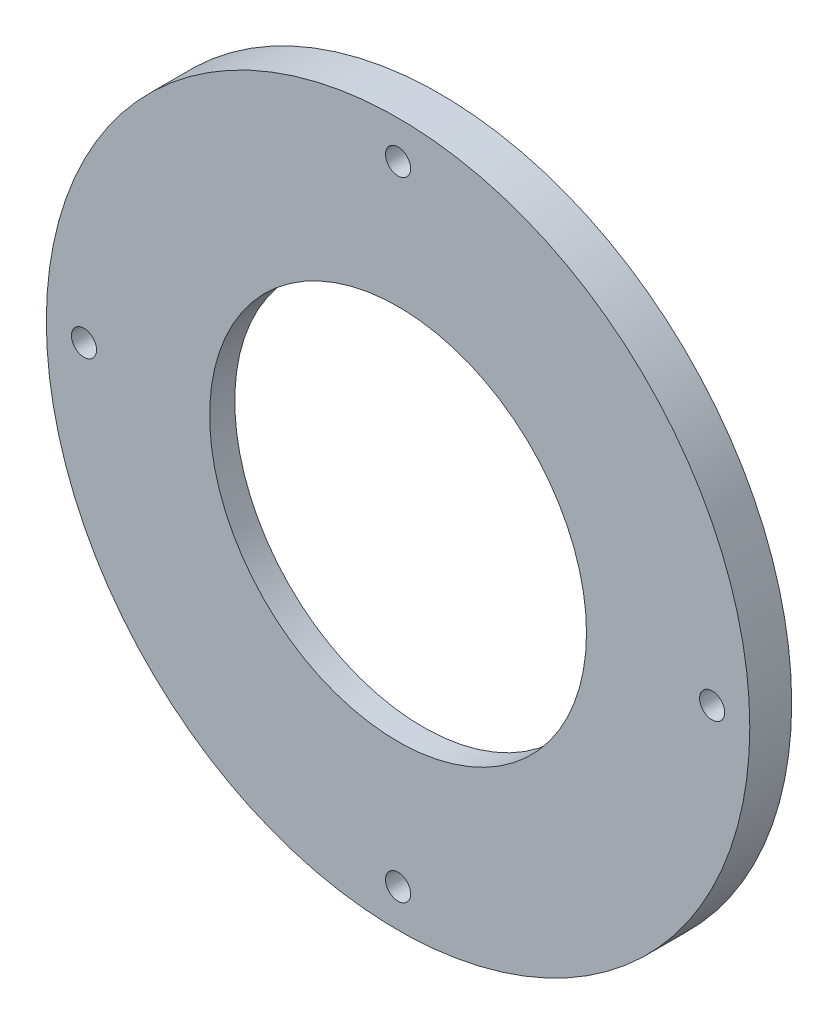
ISO-10303-21;
HEADER;
FILE_DESCRIPTION(('STEP AP214'),'2;1');
FILE_NAME('part.step','',(''),(''),'','','');
FILE_SCHEMA(('AUTOMOTIVE_DESIGN { 1 0 10303 214 1 1 1 1 }'));
ENDSEC;
DATA;
#1=APPLICATION_CONTEXT('core data for automotive mechanical design processes');
#2=APPLICATION_PROTOCOL_DEFINITION('international standard','automotive_design',2000,#1);
#3=PRODUCT_CONTEXT('',#1,'mechanical');
#4=PRODUCT('Part','Part','',(#3));
#5=PRODUCT_RELATED_PRODUCT_CATEGORY('part','',(#4));
#6=PRODUCT_DEFINITION_FORMATION('','',#4);
#7=PRODUCT_DEFINITION_CONTEXT('part definition',#1,'design');
#8=PRODUCT_DEFINITION('design','',#6,#7);
#9=PRODUCT_DEFINITION_SHAPE('','',#8);
#10=(LENGTH_UNIT() NAMED_UNIT(*) SI_UNIT(.MILLI.,.METRE.));
#11=(NAMED_UNIT(*) PLANE_ANGLE_UNIT() SI_UNIT($,.RADIAN.));
#12=(NAMED_UNIT(*) SI_UNIT($,.STERADIAN.) SOLID_ANGLE_UNIT());
#13=UNCERTAINTY_MEASURE_WITH_UNIT(LENGTH_MEASURE(1.E-05),#10,'distance_accuracy_value','');
#14=(GEOMETRIC_REPRESENTATION_CONTEXT(3) GLOBAL_UNCERTAINTY_ASSIGNED_CONTEXT((#13)) GLOBAL_UNIT_ASSIGNED_CONTEXT((#10,
#11,#12)) REPRESENTATION_CONTEXT('',''));
#15=CARTESIAN_POINT('',(0.,0.,0.));
#16=DIRECTION('',(0.,0.,1.));
#17=DIRECTION('',(1.,0.,0.));
#18=AXIS2_PLACEMENT_3D('',#15,#16,#17);
#19=CARTESIAN_POINT('',(0.,0.,5.));
#20=DIRECTION('',(0.,0.,-1.));
#21=DIRECTION('',(-1.,0.,0.));
#22=AXIS2_PLACEMENT_3D('',#19,#20,#21);
#23=CYLINDRICAL_SURFACE('',#22,42.);
#24=CARTESIAN_POINT('',(0.,0.,5.));
#25=DIRECTION('',(0.,0.,1.));
#26=DIRECTION('',(1.,0.,0.));
#27=AXIS2_PLACEMENT_3D('',#24,#25,#26);
#28=CIRCLE('',#27,42.);
#29=CARTESIAN_POINT('',(42.,0.,5.));
#30=VERTEX_POINT('',#29);
#31=EDGE_CURVE('E47',#30,#30,#28,.T.);
#32=ORIENTED_EDGE('',*,*,#31,.F.);
#33=EDGE_LOOP('',(#32));
#34=FACE_BOUND('',#33,.T.);
#35=CARTESIAN_POINT('',(0.,0.,0.));
#36=DIRECTION('',(0.,0.,1.));
#37=DIRECTION('',(1.,0.,0.));
#38=AXIS2_PLACEMENT_3D('',#35,#36,#37);
#39=CIRCLE('',#38,42.);
#40=CARTESIAN_POINT('',(42.,0.,0.));
#41=VERTEX_POINT('',#40);
#42=EDGE_CURVE('E72',#41,#41,#39,.T.);
#43=ORIENTED_EDGE('',*,*,#42,.T.);
#44=EDGE_LOOP('',(#43));
#45=FACE_BOUND('',#44,.T.);
#46=ADVANCED_FACE('F39',(#34,#45),#23,.T.);
#47=CARTESIAN_POINT('',(0.,37.5,5.));
#48=DIRECTION('',(0.,0.,-1.));
#49=DIRECTION('',(-1.,0.,0.));
#50=AXIS2_PLACEMENT_3D('',#47,#48,#49);
#51=CYLINDRICAL_SURFACE('',#50,1.5);
#52=CARTESIAN_POINT('',(0.,37.5,5.));
#53=DIRECTION('',(0.,0.,1.));
#54=DIRECTION('',(1.,0.,0.));
#55=AXIS2_PLACEMENT_3D('',#52,#53,#54);
#56=CIRCLE('',#55,1.5);
#57=CARTESIAN_POINT('',(1.5,37.5,5.));
#58=VERTEX_POINT('',#57);
#59=EDGE_CURVE('E53',#58,#58,#56,.T.);
#60=ORIENTED_EDGE('',*,*,#59,.T.);
#61=EDGE_LOOP('',(#60));
#62=FACE_BOUND('',#61,.T.);
#63=CARTESIAN_POINT('',(0.,37.5,0.));
#64=DIRECTION('',(0.,0.,1.));
#65=DIRECTION('',(1.,0.,0.));
#66=AXIS2_PLACEMENT_3D('',#63,#64,#65);
#67=CIRCLE('',#66,1.5);
#68=CARTESIAN_POINT('',(1.5,37.5,0.));
#69=VERTEX_POINT('',#68);
#70=EDGE_CURVE('E69',#69,#69,#67,.T.);
#71=ORIENTED_EDGE('',*,*,#70,.F.);
#72=EDGE_LOOP('',(#71));
#73=FACE_BOUND('',#72,.T.);
#74=ADVANCED_FACE('F105',(#62,#73),#51,.F.);
#75=CARTESIAN_POINT('',(-37.5,0.,5.));
#76=DIRECTION('',(0.,0.,-1.));
#77=DIRECTION('',(-1.,0.,0.));
#78=AXIS2_PLACEMENT_3D('',#75,#76,#77);
#79=CYLINDRICAL_SURFACE('',#78,1.5);
#80=CARTESIAN_POINT('',(-37.5,0.,5.));
#81=DIRECTION('',(0.,0.,1.));
#82=DIRECTION('',(1.,0.,0.));
#83=AXIS2_PLACEMENT_3D('',#80,#81,#82);
#84=CIRCLE('',#83,1.5);
#85=CARTESIAN_POINT('',(-36.,0.,5.));
#86=VERTEX_POINT('',#85);
#87=EDGE_CURVE('E92',#86,#86,#84,.T.);
#88=ORIENTED_EDGE('',*,*,#87,.T.);
#89=EDGE_LOOP('',(#88));
#90=FACE_BOUND('',#89,.T.);
#91=CARTESIAN_POINT('',(-37.5,0.,0.));
#92=DIRECTION('',(0.,0.,1.));
#93=DIRECTION('',(1.,0.,0.));
#94=AXIS2_PLACEMENT_3D('',#91,#92,#93);
#95=CIRCLE('',#94,1.5);
#96=CARTESIAN_POINT('',(-36.,0.,0.));
#97=VERTEX_POINT('',#96);
#98=EDGE_CURVE('E65',#97,#97,#95,.T.);
#99=ORIENTED_EDGE('',*,*,#98,.F.);
#100=EDGE_LOOP('',(#99));
#101=FACE_BOUND('',#100,.T.);
#102=ADVANCED_FACE('F123',(#90,#101),#79,.F.);
#103=CARTESIAN_POINT('',(37.5,0.,5.));
#104=DIRECTION('',(0.,0.,-1.));
#105=DIRECTION('',(-1.,0.,0.));
#106=AXIS2_PLACEMENT_3D('',#103,#104,#105);
#107=CYLINDRICAL_SURFACE('',#106,1.5);
#108=CARTESIAN_POINT('',(37.5,0.,5.));
#109=DIRECTION('',(0.,0.,1.));
#110=DIRECTION('',(1.,0.,0.));
#111=AXIS2_PLACEMENT_3D('',#108,#109,#110);
#112=CIRCLE('',#111,1.5);
#113=CARTESIAN_POINT('',(39.,0.,5.));
#114=VERTEX_POINT('',#113);
#115=EDGE_CURVE('E83',#114,#114,#112,.T.);
#116=ORIENTED_EDGE('',*,*,#115,.T.);
#117=EDGE_LOOP('',(#116));
#118=FACE_BOUND('',#117,.T.);
#119=CARTESIAN_POINT('',(37.5,0.,0.));
#120=DIRECTION('',(0.,0.,1.));
#121=DIRECTION('',(1.,0.,0.));
#122=AXIS2_PLACEMENT_3D('',#119,#120,#121);
#123=CIRCLE('',#122,1.5);
#124=CARTESIAN_POINT('',(39.,0.,0.));
#125=VERTEX_POINT('',#124);
#126=EDGE_CURVE('E61',#125,#125,#123,.T.);
#127=ORIENTED_EDGE('',*,*,#126,.F.);
#128=EDGE_LOOP('',(#127));
#129=FACE_BOUND('',#128,.T.);
#130=ADVANCED_FACE('F129',(#118,#129),#107,.F.);
#131=CARTESIAN_POINT('',(0.,-37.5,5.));
#132=DIRECTION('',(0.,0.,-1.));
#133=DIRECTION('',(-1.,0.,0.));
#134=AXIS2_PLACEMENT_3D('',#131,#132,#133);
#135=CYLINDRICAL_SURFACE('',#134,1.5);
#136=CARTESIAN_POINT('',(0.,-37.5,5.));
#137=DIRECTION('',(0.,0.,1.));
#138=DIRECTION('',(1.,0.,0.));
#139=AXIS2_PLACEMENT_3D('',#136,#137,#138);
#140=CIRCLE('',#139,1.5);
#141=CARTESIAN_POINT('',(1.5,-37.5,5.));
#142=VERTEX_POINT('',#141);
#143=EDGE_CURVE('E75',#142,#142,#140,.T.);
#144=ORIENTED_EDGE('',*,*,#143,.T.);
#145=EDGE_LOOP('',(#144));
#146=FACE_BOUND('',#145,.T.);
#147=CARTESIAN_POINT('',(0.,-37.5,0.));
#148=DIRECTION('',(0.,0.,1.));
#149=DIRECTION('',(1.,0.,0.));
#150=AXIS2_PLACEMENT_3D('',#147,#148,#149);
#151=CIRCLE('',#150,1.5);
#152=CARTESIAN_POINT('',(1.5,-37.5,0.));
#153=VERTEX_POINT('',#152);
#154=EDGE_CURVE('E57',#153,#153,#151,.T.);
#155=ORIENTED_EDGE('',*,*,#154,.F.);
#156=EDGE_LOOP('',(#155));
#157=FACE_BOUND('',#156,.T.);
#158=ADVANCED_FACE('F41',(#146,#157),#135,.F.);
#159=CARTESIAN_POINT('',(0.,0.,5.));
#160=DIRECTION('',(0.,0.,-1.));
#161=DIRECTION('',(-1.,0.,0.));
#162=AXIS2_PLACEMENT_3D('',#159,#160,#161);
#163=CYLINDRICAL_SURFACE('',#162,22.5);
#164=CARTESIAN_POINT('',(0.,0.,2.));
#165=DIRECTION('',(0.,0.,1.));
#166=DIRECTION('',(1.,0.,0.));
#167=AXIS2_PLACEMENT_3D('',#164,#165,#166);
#168=CIRCLE('',#167,22.5);
#169=CARTESIAN_POINT('',(22.5,0.,2.));
#170=VERTEX_POINT('',#169);
#171=EDGE_CURVE('E43',#170,#170,#168,.T.);
#172=ORIENTED_EDGE('',*,*,#171,.F.);
#173=EDGE_LOOP('',(#172));
#174=FACE_BOUND('',#173,.T.);
#175=CARTESIAN_POINT('',(0.,0.,5.));
#176=DIRECTION('',(0.,0.,1.));
#177=DIRECTION('',(1.,0.,0.));
#178=AXIS2_PLACEMENT_3D('',#175,#176,#177);
#179=CIRCLE('',#178,22.5);
#180=CARTESIAN_POINT('',(22.5,0.,5.));
#181=VERTEX_POINT('',#180);
#182=EDGE_CURVE('E10',#181,#181,#179,.T.);
#183=ORIENTED_EDGE('',*,*,#182,.T.);
#184=EDGE_LOOP('',(#183));
#185=FACE_BOUND('',#184,.T.);
#186=ADVANCED_FACE('F112',(#174,#185),#163,.F.);
#187=CARTESIAN_POINT('',(0.,0.,5.));
#188=DIRECTION('',(0.,0.,1.));
#189=DIRECTION('',(1.,0.,0.));
#190=AXIS2_PLACEMENT_3D('',#187,#188,#189);
#191=PLANE('',#190);
#192=ORIENTED_EDGE('',*,*,#143,.F.);
#193=EDGE_LOOP('',(#192));
#194=FACE_BOUND('',#193,.T.);
#195=ORIENTED_EDGE('',*,*,#115,.F.);
#196=EDGE_LOOP('',(#195));
#197=FACE_BOUND('',#196,.T.);
#198=ORIENTED_EDGE('',*,*,#87,.F.);
#199=EDGE_LOOP('',(#198));
#200=FACE_BOUND('',#199,.T.);
#201=ORIENTED_EDGE('',*,*,#59,.F.);
#202=EDGE_LOOP('',(#201));
#203=FACE_BOUND('',#202,.T.);
#204=ORIENTED_EDGE('',*,*,#31,.T.);
#205=EDGE_LOOP('',(#204));
#206=FACE_BOUND('',#205,.T.);
#207=ORIENTED_EDGE('',*,*,#182,.F.);
#208=EDGE_LOOP('',(#207));
#209=FACE_BOUND('',#208,.T.);
#210=ADVANCED_FACE('F108',(#194,#197,#200,#203,#206,#209),#191,.T.);
#211=CARTESIAN_POINT('',(0.,0.,0.));
#212=DIRECTION('',(0.,0.,1.));
#213=DIRECTION('',(1.,0.,0.));
#214=AXIS2_PLACEMENT_3D('',#211,#212,#213);
#215=PLANE('',#214);
#216=CARTESIAN_POINT('',(0.,0.,0.));
#217=DIRECTION('',(0.,0.,1.));
#218=DIRECTION('',(1.,0.,0.));
#219=AXIS2_PLACEMENT_3D('',#216,#217,#218);
#220=CIRCLE('',#219,32.6);
#221=CARTESIAN_POINT('',(32.6,0.,0.));
#222=VERTEX_POINT('',#221);
#223=EDGE_CURVE('E95',#222,#222,#220,.T.);
#224=ORIENTED_EDGE('',*,*,#223,.T.);
#225=EDGE_LOOP('',(#224));
#226=FACE_BOUND('',#225,.T.);
#227=ORIENTED_EDGE('',*,*,#154,.T.);
#228=EDGE_LOOP('',(#227));
#229=FACE_BOUND('',#228,.T.);
#230=ORIENTED_EDGE('',*,*,#126,.T.);
#231=EDGE_LOOP('',(#230));
#232=FACE_BOUND('',#231,.T.);
#233=ORIENTED_EDGE('',*,*,#98,.T.);
#234=EDGE_LOOP('',(#233));
#235=FACE_BOUND('',#234,.T.);
#236=ORIENTED_EDGE('',*,*,#70,.T.);
#237=EDGE_LOOP('',(#236));
#238=FACE_BOUND('',#237,.T.);
#239=ORIENTED_EDGE('',*,*,#42,.F.);
#240=EDGE_LOOP('',(#239));
#241=FACE_BOUND('',#240,.T.);
#242=ADVANCED_FACE('F111',(#226,#229,#232,#235,#238,#241),#215,.F.);
#243=CARTESIAN_POINT('',(0.,0.,2.));
#244=DIRECTION('',(0.,0.,-1.));
#245=DIRECTION('',(-1.,0.,0.));
#246=AXIS2_PLACEMENT_3D('',#243,#244,#245);
#247=CYLINDRICAL_SURFACE('',#246,32.6);
#248=CARTESIAN_POINT('',(0.,0.,2.));
#249=DIRECTION('',(0.,0.,1.));
#250=DIRECTION('',(1.,0.,0.));
#251=AXIS2_PLACEMENT_3D('',#248,#249,#250);
#252=CIRCLE('',#251,32.6);
#253=CARTESIAN_POINT('',(32.6,0.,2.));
#254=VERTEX_POINT('',#253);
#255=EDGE_CURVE('E166',#254,#254,#252,.T.);
#256=ORIENTED_EDGE('',*,*,#255,.T.);
#257=EDGE_LOOP('',(#256));
#258=FACE_BOUND('',#257,.T.);
#259=ORIENTED_EDGE('',*,*,#223,.F.);
#260=EDGE_LOOP('',(#259));
#261=FACE_BOUND('',#260,.T.);
#262=ADVANCED_FACE('F142',(#258,#261),#247,.F.);
#263=CARTESIAN_POINT('',(0.,0.,2.));
#264=DIRECTION('',(0.,0.,1.));
#265=DIRECTION('',(1.,0.,0.));
#266=AXIS2_PLACEMENT_3D('',#263,#264,#265);
#267=PLANE('',#266);
#268=ORIENTED_EDGE('',*,*,#171,.T.);
#269=EDGE_LOOP('',(#268));
#270=FACE_BOUND('',#269,.T.);
#271=ORIENTED_EDGE('',*,*,#255,.F.);
#272=EDGE_LOOP('',(#271));
#273=FACE_BOUND('',#272,.T.);
#274=ADVANCED_FACE('F152',(#270,#273),#267,.F.);
#275=CLOSED_SHELL('',(#46,#74,#102,#130,#158,#186,#210,#242,#262,#274));
#276=MANIFOLD_SOLID_BREP('B2',#275);
#277=ADVANCED_BREP_SHAPE_REPRESENTATION('',(#18,#276),#14);
#278=SHAPE_DEFINITION_REPRESENTATION(#9,#277);
ENDSEC;
END-ISO-10303-21;
